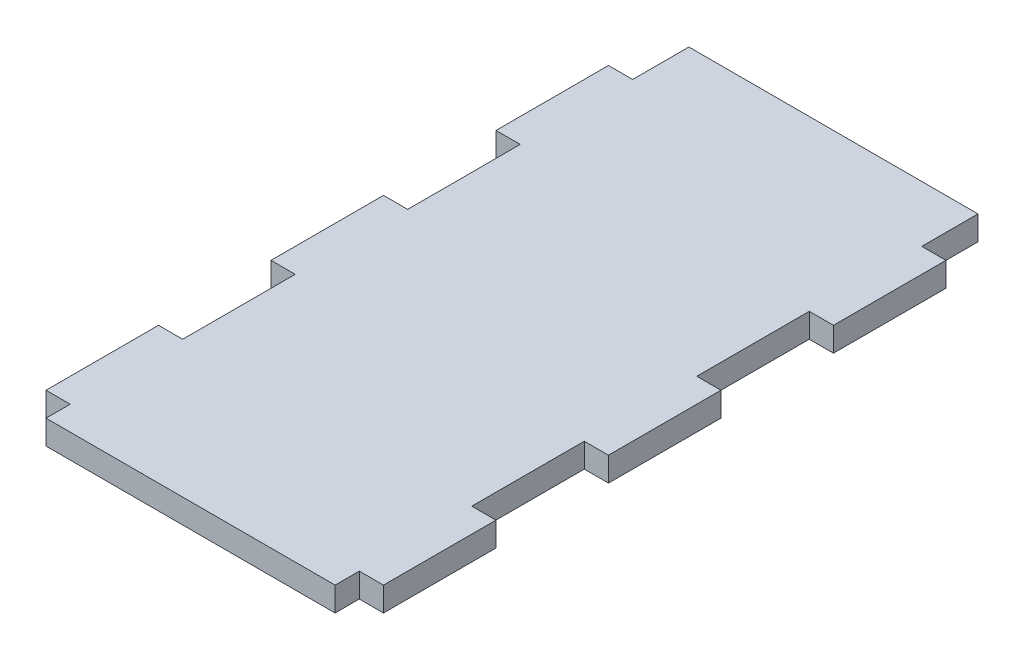
ISO-10303-21;
HEADER;
FILE_DESCRIPTION(('STEP AP214'),'2;1');
FILE_NAME('part.step','',(''),(''),'','','');
FILE_SCHEMA(('AUTOMOTIVE_DESIGN { 1 0 10303 214 1 1 1 1 }'));
ENDSEC;
DATA;
#1=APPLICATION_CONTEXT('core data for automotive mechanical design processes');
#2=APPLICATION_PROTOCOL_DEFINITION('international standard','automotive_design',2000,#1);
#3=PRODUCT_CONTEXT('',#1,'mechanical');
#4=PRODUCT('Part','Part','',(#3));
#5=PRODUCT_RELATED_PRODUCT_CATEGORY('part','',(#4));
#6=PRODUCT_DEFINITION_FORMATION('','',#4);
#7=PRODUCT_DEFINITION_CONTEXT('part definition',#1,'design');
#8=PRODUCT_DEFINITION('design','',#6,#7);
#9=PRODUCT_DEFINITION_SHAPE('','',#8);
#10=(LENGTH_UNIT() NAMED_UNIT(*) SI_UNIT(.MILLI.,.METRE.));
#11=(NAMED_UNIT(*) PLANE_ANGLE_UNIT() SI_UNIT($,.RADIAN.));
#12=(NAMED_UNIT(*) SI_UNIT($,.STERADIAN.) SOLID_ANGLE_UNIT());
#13=UNCERTAINTY_MEASURE_WITH_UNIT(LENGTH_MEASURE(1.E-05),#10,'distance_accuracy_value','');
#14=(GEOMETRIC_REPRESENTATION_CONTEXT(3) GLOBAL_UNCERTAINTY_ASSIGNED_CONTEXT((#13)) GLOBAL_UNIT_ASSIGNED_CONTEXT((#10,
#11,#12)) REPRESENTATION_CONTEXT('',''));
#15=CARTESIAN_POINT('',(0.,0.,0.));
#16=DIRECTION('',(0.,0.,1.));
#17=DIRECTION('',(1.,0.,0.));
#18=AXIS2_PLACEMENT_3D('',#15,#16,#17);
#19=CARTESIAN_POINT('',(38.1,5.461,-63.5));
#20=DIRECTION('',(0.,0.,1.));
#21=DIRECTION('',(1.,0.,0.));
#22=AXIS2_PLACEMENT_3D('',#19,#20,#21);
#23=PLANE('',#22);
#24=DIRECTION('',(0.,-1.,0.));
#25=VECTOR('',#24,1.);
#26=CARTESIAN_POINT('',(32.639,5.461,-63.5));
#27=LINE('',#26,#25);
#28=CARTESIAN_POINT('',(32.639,5.461,-63.5));
#29=VERTEX_POINT('',#28);
#30=CARTESIAN_POINT('',(32.639,0.,-63.5));
#31=VERTEX_POINT('',#30);
#32=EDGE_CURVE('E249',#29,#31,#27,.T.);
#33=ORIENTED_EDGE('',*,*,#32,.F.);
#34=DIRECTION('',(-1.,0.,0.));
#35=VECTOR('',#34,1.);
#36=CARTESIAN_POINT('',(38.1,5.461,-63.5));
#37=LINE('',#36,#35);
#38=CARTESIAN_POINT('',(38.1,5.461,-63.5));
#39=VERTEX_POINT('',#38);
#40=EDGE_CURVE('E393',#39,#29,#37,.T.);
#41=ORIENTED_EDGE('',*,*,#40,.F.);
#42=DIRECTION('',(0.,-1.,0.));
#43=VECTOR('',#42,1.);
#44=CARTESIAN_POINT('',(38.1,5.461,-63.5));
#45=LINE('',#44,#43);
#46=CARTESIAN_POINT('',(38.1,0.,-63.5));
#47=VERTEX_POINT('',#46);
#48=EDGE_CURVE('E414',#39,#47,#45,.T.);
#49=ORIENTED_EDGE('',*,*,#48,.T.);
#50=DIRECTION('',(-1.,0.,0.));
#51=VECTOR('',#50,1.);
#52=CARTESIAN_POINT('',(38.1,0.,-63.5));
#53=LINE('',#52,#51);
#54=EDGE_CURVE('E64',#47,#31,#53,.T.);
#55=ORIENTED_EDGE('',*,*,#54,.T.);
#56=EDGE_LOOP('',(#33,#41,#49,#55));
#57=FACE_BOUND('',#56,.T.);
#58=ADVANCED_FACE('F41',(#57),#23,.F.);
#59=DIRECTION('',(0.,1.,0.));
#60=VECTOR('',#59,1.);
#61=CARTESIAN_POINT('',(-32.639,5.46100000000001,-63.5));
#62=LINE('',#61,#60);
#63=CARTESIAN_POINT('',(-32.639,0.,-63.5));
#64=VERTEX_POINT('',#63);
#65=CARTESIAN_POINT('',(-32.639,5.46100000000001,-63.5));
#66=VERTEX_POINT('',#65);
#67=EDGE_CURVE('E56',#64,#66,#62,.T.);
#68=ORIENTED_EDGE('',*,*,#67,.F.);
#69=CARTESIAN_POINT('',(-38.1,0.,-63.5));
#70=VERTEX_POINT('',#69);
#71=EDGE_CURVE('E409',#64,#70,#53,.T.);
#72=ORIENTED_EDGE('',*,*,#71,.T.);
#73=DIRECTION('',(0.,-1.,0.));
#74=VECTOR('',#73,1.);
#75=CARTESIAN_POINT('',(-38.1,5.461,-63.5));
#76=LINE('',#75,#74);
#77=CARTESIAN_POINT('',(-38.1,5.461,-63.5));
#78=VERTEX_POINT('',#77);
#79=EDGE_CURVE('E396',#78,#70,#76,.T.);
#80=ORIENTED_EDGE('',*,*,#79,.F.);
#81=EDGE_CURVE('E391',#66,#78,#37,.T.);
#82=ORIENTED_EDGE('',*,*,#81,.F.);
#83=EDGE_LOOP('',(#68,#72,#80,#82));
#84=FACE_BOUND('',#83,.T.);
#85=ADVANCED_FACE('F493',(#84),#23,.F.);
#86=CARTESIAN_POINT('',(38.1,5.461,63.5));
#87=DIRECTION('',(0.,0.,-1.));
#88=DIRECTION('',(-1.,0.,0.));
#89=AXIS2_PLACEMENT_3D('',#86,#87,#88);
#90=PLANE('',#89);
#91=DIRECTION('',(0.,-1.,0.));
#92=VECTOR('',#91,1.);
#93=CARTESIAN_POINT('',(-32.639,5.461,63.5));
#94=LINE('',#93,#92);
#95=CARTESIAN_POINT('',(-32.639,5.461,63.5));
#96=VERTEX_POINT('',#95);
#97=CARTESIAN_POINT('',(-32.639,0.,63.5));
#98=VERTEX_POINT('',#97);
#99=EDGE_CURVE('E250',#96,#98,#94,.T.);
#100=ORIENTED_EDGE('',*,*,#99,.F.);
#101=DIRECTION('',(1.,0.,0.));
#102=VECTOR('',#101,1.);
#103=CARTESIAN_POINT('',(38.1,5.461,63.5));
#104=LINE('',#103,#102);
#105=CARTESIAN_POINT('',(-38.1,5.461,63.5));
#106=VERTEX_POINT('',#105);
#107=EDGE_CURVE('E384',#106,#96,#104,.T.);
#108=ORIENTED_EDGE('',*,*,#107,.F.);
#109=DIRECTION('',(0.,-1.,0.));
#110=VECTOR('',#109,1.);
#111=CARTESIAN_POINT('',(-38.1,5.461,63.5));
#112=LINE('',#111,#110);
#113=CARTESIAN_POINT('',(-38.1,0.,63.5));
#114=VERTEX_POINT('',#113);
#115=EDGE_CURVE('E12',#106,#114,#112,.T.);
#116=ORIENTED_EDGE('',*,*,#115,.T.);
#117=DIRECTION('',(1.,0.,0.));
#118=VECTOR('',#117,1.);
#119=CARTESIAN_POINT('',(38.1,0.,63.5));
#120=LINE('',#119,#118);
#121=EDGE_CURVE('E403',#114,#98,#120,.T.);
#122=ORIENTED_EDGE('',*,*,#121,.T.);
#123=EDGE_LOOP('',(#100,#108,#116,#122));
#124=FACE_BOUND('',#123,.T.);
#125=ADVANCED_FACE('F456',(#124),#90,.F.);
#126=DIRECTION('',(0.,1.,0.));
#127=VECTOR('',#126,1.);
#128=CARTESIAN_POINT('',(32.639,5.46100000000001,63.5));
#129=LINE('',#128,#127);
#130=CARTESIAN_POINT('',(32.639,0.,63.5));
#131=VERTEX_POINT('',#130);
#132=CARTESIAN_POINT('',(32.639,5.46100000000001,63.5));
#133=VERTEX_POINT('',#132);
#134=EDGE_CURVE('E253',#131,#133,#129,.T.);
#135=ORIENTED_EDGE('',*,*,#134,.F.);
#136=CARTESIAN_POINT('',(38.1,0.,63.5));
#137=VERTEX_POINT('',#136);
#138=EDGE_CURVE('E400',#131,#137,#120,.T.);
#139=ORIENTED_EDGE('',*,*,#138,.T.);
#140=DIRECTION('',(0.,-1.,0.));
#141=VECTOR('',#140,1.);
#142=CARTESIAN_POINT('',(38.1,5.461,63.5));
#143=LINE('',#142,#141);
#144=CARTESIAN_POINT('',(38.1,5.461,63.5));
#145=VERTEX_POINT('',#144);
#146=EDGE_CURVE('E49',#145,#137,#143,.T.);
#147=ORIENTED_EDGE('',*,*,#146,.F.);
#148=EDGE_CURVE('E381',#133,#145,#104,.T.);
#149=ORIENTED_EDGE('',*,*,#148,.F.);
#150=EDGE_LOOP('',(#135,#139,#147,#149));
#151=FACE_BOUND('',#150,.T.);
#152=ADVANCED_FACE('F442',(#151),#90,.F.);
#153=CARTESIAN_POINT('',(-38.1,5.461,63.5));
#154=DIRECTION('',(1.,0.,0.));
#155=DIRECTION('',(0.,0.,-1.));
#156=AXIS2_PLACEMENT_3D('',#153,#154,#155);
#157=PLANE('',#156);
#158=DIRECTION('',(0.,0.,1.));
#159=VECTOR('',#158,1.);
#160=CARTESIAN_POINT('',(-38.1,0.,63.5));
#161=LINE('',#160,#159);
#162=CARTESIAN_POINT('',(-38.100000000001,0.,-38.0999999999997));
#163=VERTEX_POINT('',#162);
#164=EDGE_CURVE('E397',#70,#163,#161,.T.);
#165=ORIENTED_EDGE('',*,*,#164,.T.);
#166=DIRECTION('',(0.,1.,0.));
#167=VECTOR('',#166,1.);
#168=CARTESIAN_POINT('',(-38.100000000001,0.,-38.0999999999997));
#169=LINE('',#168,#167);
#170=CARTESIAN_POINT('',(-38.100000000001,5.46099999999997,-38.0999999999998));
#171=VERTEX_POINT('',#170);
#172=EDGE_CURVE('E299',#163,#171,#169,.T.);
#173=ORIENTED_EDGE('',*,*,#172,.T.);
#174=DIRECTION('',(0.,0.,1.));
#175=VECTOR('',#174,1.);
#176=CARTESIAN_POINT('',(-38.1,5.461,63.5));
#177=LINE('',#176,#175);
#178=EDGE_CURVE('E378',#78,#171,#177,.T.);
#179=ORIENTED_EDGE('',*,*,#178,.F.);
#180=ORIENTED_EDGE('',*,*,#79,.T.);
#181=EDGE_LOOP('',(#165,#173,#179,#180));
#182=FACE_BOUND('',#181,.T.);
#183=ADVANCED_FACE('F490',(#182),#157,.F.);
#184=CARTESIAN_POINT('',(-38.1000000000009,5.46099999999996,-12.6999999999998));
#185=VERTEX_POINT('',#184);
#186=CARTESIAN_POINT('',(-38.1000000000008,5.46099999999996,12.7000000000002));
#187=VERTEX_POINT('',#186);
#188=EDGE_CURVE('E382',#185,#187,#177,.T.);
#189=ORIENTED_EDGE('',*,*,#188,.F.);
#190=DIRECTION('',(0.,-1.,0.));
#191=VECTOR('',#190,1.);
#192=CARTESIAN_POINT('',(-38.1000000000009,0.,-12.6999999999997));
#193=LINE('',#192,#191);
#194=CARTESIAN_POINT('',(-38.1000000000009,0.,-12.6999999999997));
#195=VERTEX_POINT('',#194);
#196=EDGE_CURVE('E287',#185,#195,#193,.T.);
#197=ORIENTED_EDGE('',*,*,#196,.T.);
#198=CARTESIAN_POINT('',(-38.1000000000008,0.,12.7000000000002));
#199=VERTEX_POINT('',#198);
#200=EDGE_CURVE('E401',#195,#199,#161,.T.);
#201=ORIENTED_EDGE('',*,*,#200,.T.);
#202=DIRECTION('',(0.,1.,0.));
#203=VECTOR('',#202,1.);
#204=CARTESIAN_POINT('',(-38.1000000000008,0.,12.7000000000002));
#205=LINE('',#204,#203);
#206=EDGE_CURVE('E290',#199,#187,#205,.T.);
#207=ORIENTED_EDGE('',*,*,#206,.T.);
#208=EDGE_LOOP('',(#189,#197,#201,#207));
#209=FACE_BOUND('',#208,.T.);
#210=ADVANCED_FACE('F466',(#209),#157,.F.);
#211=CARTESIAN_POINT('',(38.1,5.461,63.5));
#212=DIRECTION('',(-1.,0.,0.));
#213=DIRECTION('',(0.,0.,1.));
#214=AXIS2_PLACEMENT_3D('',#211,#212,#213);
#215=PLANE('',#214);
#216=DIRECTION('',(0.,-1.,0.));
#217=VECTOR('',#216,1.);
#218=CARTESIAN_POINT('',(38.0999999999997,1.66533453693773E-13,38.1));
#219=LINE('',#218,#217);
#220=CARTESIAN_POINT('',(38.0999999999996,5.46100000000015,38.1));
#221=VERTEX_POINT('',#220);
#222=CARTESIAN_POINT('',(38.0999999999997,1.66533453693773E-13,38.1));
#223=VERTEX_POINT('',#222);
#224=EDGE_CURVE('E361',#221,#223,#219,.T.);
#225=ORIENTED_EDGE('',*,*,#224,.F.);
#226=DIRECTION('',(0.,0.,-1.));
#227=VECTOR('',#226,1.);
#228=CARTESIAN_POINT('',(38.1,5.461,63.5));
#229=LINE('',#228,#227);
#230=EDGE_CURVE('E388',#145,#221,#229,.T.);
#231=ORIENTED_EDGE('',*,*,#230,.F.);
#232=ORIENTED_EDGE('',*,*,#146,.T.);
#233=DIRECTION('',(0.,0.,-1.));
#234=VECTOR('',#233,1.);
#235=CARTESIAN_POINT('',(38.1,0.,63.5));
#236=LINE('',#235,#234);
#237=EDGE_CURVE('E406',#137,#223,#236,.T.);
#238=ORIENTED_EDGE('',*,*,#237,.T.);
#239=EDGE_LOOP('',(#225,#231,#232,#238));
#240=FACE_BOUND('',#239,.T.);
#241=ADVANCED_FACE('F421',(#240),#215,.F.);
#242=DIRECTION('',(0.,1.,0.));
#243=VECTOR('',#242,1.);
#244=CARTESIAN_POINT('',(38.0999999999997,1.80411241501588E-13,12.7));
#245=LINE('',#244,#243);
#246=CARTESIAN_POINT('',(38.0999999999997,1.80411241501588E-13,12.7));
#247=VERTEX_POINT('',#246);
#248=CARTESIAN_POINT('',(38.0999999999996,5.46100000000014,12.7));
#249=VERTEX_POINT('',#248);
#250=EDGE_CURVE('E329',#247,#249,#245,.T.);
#251=ORIENTED_EDGE('',*,*,#250,.F.);
#252=CARTESIAN_POINT('',(38.0999999999997,2.08166817117217E-13,-12.6999999999999));
#253=VERTEX_POINT('',#252);
#254=EDGE_CURVE('E410',#247,#253,#236,.T.);
#255=ORIENTED_EDGE('',*,*,#254,.T.);
#256=DIRECTION('',(0.,-1.,0.));
#257=VECTOR('',#256,1.);
#258=CARTESIAN_POINT('',(38.0999999999997,2.08166817117217E-13,-12.6999999999999));
#259=LINE('',#258,#257);
#260=CARTESIAN_POINT('',(38.0999999999996,5.46100000000014,-12.6999999999999));
#261=VERTEX_POINT('',#260);
#262=EDGE_CURVE('E331',#261,#253,#259,.T.);
#263=ORIENTED_EDGE('',*,*,#262,.F.);
#264=EDGE_CURVE('E392',#249,#261,#229,.T.);
#265=ORIENTED_EDGE('',*,*,#264,.F.);
#266=EDGE_LOOP('',(#251,#255,#263,#265));
#267=FACE_BOUND('',#266,.T.);
#268=ADVANCED_FACE('F517',(#267),#215,.F.);
#269=DIRECTION('',(0.,1.,0.));
#270=VECTOR('',#269,1.);
#271=CARTESIAN_POINT('',(38.0999999999997,2.15105711021124E-13,-38.0999999999999));
#272=LINE('',#271,#270);
#273=CARTESIAN_POINT('',(38.0999999999997,2.15105711021124E-13,-38.0999999999999));
#274=VERTEX_POINT('',#273);
#275=CARTESIAN_POINT('',(38.0999999999996,5.46100000000015,-38.1));
#276=VERTEX_POINT('',#275);
#277=EDGE_CURVE('E351',#274,#276,#272,.T.);
#278=ORIENTED_EDGE('',*,*,#277,.F.);
#279=EDGE_CURVE('E405',#274,#47,#236,.T.);
#280=ORIENTED_EDGE('',*,*,#279,.T.);
#281=ORIENTED_EDGE('',*,*,#48,.F.);
#282=EDGE_CURVE('E387',#276,#39,#229,.T.);
#283=ORIENTED_EDGE('',*,*,#282,.F.);
#284=EDGE_LOOP('',(#278,#280,#281,#283));
#285=FACE_BOUND('',#284,.T.);
#286=ADVANCED_FACE('F526',(#285),#215,.F.);
#287=CARTESIAN_POINT('',(0.,0.,0.));
#288=DIRECTION('',(0.,1.,0.));
#289=DIRECTION('',(0.,0.,1.));
#290=AXIS2_PLACEMENT_3D('',#287,#288,#289);
#291=PLANE('',#290);
#292=DIRECTION('',(0.,0.,-1.));
#293=VECTOR('',#292,1.);
#294=CARTESIAN_POINT('',(-32.6390000000004,0.,82.9351920908021));
#295=LINE('',#294,#293);
#296=CARTESIAN_POINT('',(-32.6390000000009,0.,-12.6999999999998));
#297=VERTEX_POINT('',#296);
#298=CARTESIAN_POINT('',(-32.639000000001,0.,-38.0999999999998));
#299=VERTEX_POINT('',#298);
#300=EDGE_CURVE('E315',#297,#299,#295,.T.);
#301=ORIENTED_EDGE('',*,*,#300,.T.);
#302=DIRECTION('',(-1.,0.,0.));
#303=VECTOR('',#302,1.);
#304=CARTESIAN_POINT('',(-32.639000000001,0.,-38.0999999999998));
#305=LINE('',#304,#303);
#306=EDGE_CURVE('E312',#299,#163,#305,.T.);
#307=ORIENTED_EDGE('',*,*,#306,.T.);
#308=ORIENTED_EDGE('',*,*,#164,.F.);
#309=ORIENTED_EDGE('',*,*,#71,.F.);
#310=DIRECTION('',(0.,0.,1.));
#311=VECTOR('',#310,1.);
#312=CARTESIAN_POINT('',(-32.639,0.,-76.2));
#313=LINE('',#312,#311);
#314=CARTESIAN_POINT('',(-32.639,0.,-76.2));
#315=VERTEX_POINT('',#314);
#316=EDGE_CURVE('E234',#315,#64,#313,.T.);
#317=ORIENTED_EDGE('',*,*,#316,.F.);
#318=DIRECTION('',(-1.,0.,0.));
#319=VECTOR('',#318,1.);
#320=CARTESIAN_POINT('',(32.639,0.,-76.2));
#321=LINE('',#320,#319);
#322=CARTESIAN_POINT('',(32.639,0.,-76.2));
#323=VERTEX_POINT('',#322);
#324=EDGE_CURVE('E226',#323,#315,#321,.T.);
#325=ORIENTED_EDGE('',*,*,#324,.F.);
#326=DIRECTION('',(0.,0.,1.));
#327=VECTOR('',#326,1.);
#328=CARTESIAN_POINT('',(32.639,0.,-76.2));
#329=LINE('',#328,#327);
#330=EDGE_CURVE('E231',#323,#31,#329,.T.);
#331=ORIENTED_EDGE('',*,*,#330,.T.);
#332=ORIENTED_EDGE('',*,*,#54,.F.);
#333=ORIENTED_EDGE('',*,*,#279,.F.);
#334=DIRECTION('',(-1.,0.,0.));
#335=VECTOR('',#334,1.);
#336=CARTESIAN_POINT('',(38.0999999999997,2.15105711021124E-13,-38.0999999999999));
#337=LINE('',#336,#335);
#338=CARTESIAN_POINT('',(32.6389999999997,1.89084858881472E-13,-38.0999999999999));
#339=VERTEX_POINT('',#338);
#340=EDGE_CURVE('E356',#274,#339,#337,.T.);
#341=ORIENTED_EDGE('',*,*,#340,.T.);
#342=DIRECTION('',(0.,0.,-1.));
#343=VECTOR('',#342,1.);
#344=CARTESIAN_POINT('',(32.6389999999997,1.28369537222284E-13,82.9351920908019));
#345=LINE('',#344,#343);
#346=CARTESIAN_POINT('',(32.6389999999997,0.,-12.6999999999999));
#347=VERTEX_POINT('',#346);
#348=EDGE_CURVE('E359',#347,#339,#345,.T.);
#349=ORIENTED_EDGE('',*,*,#348,.F.);
#350=DIRECTION('',(-1.,0.,0.));
#351=VECTOR('',#350,1.);
#352=CARTESIAN_POINT('',(38.0999999999997,2.08166817117217E-13,-12.6999999999999));
#353=LINE('',#352,#351);
#354=EDGE_CURVE('E345',#253,#347,#353,.T.);
#355=ORIENTED_EDGE('',*,*,#354,.F.);
#356=ORIENTED_EDGE('',*,*,#254,.F.);
#357=DIRECTION('',(-1.,0.,0.));
#358=VECTOR('',#357,1.);
#359=CARTESIAN_POINT('',(38.0999999999997,1.80411241501588E-13,12.7));
#360=LINE('',#359,#358);
#361=CARTESIAN_POINT('',(32.6389999999997,1.54390389361936E-13,12.7));
#362=VERTEX_POINT('',#361);
#363=EDGE_CURVE('E341',#247,#362,#360,.T.);
#364=ORIENTED_EDGE('',*,*,#363,.T.);
#365=CARTESIAN_POINT('',(32.6389999999997,0.,38.1));
#366=VERTEX_POINT('',#365);
#367=EDGE_CURVE('E323',#366,#362,#345,.T.);
#368=ORIENTED_EDGE('',*,*,#367,.F.);
#369=DIRECTION('',(-1.,0.,0.));
#370=VECTOR('',#369,1.);
#371=CARTESIAN_POINT('',(38.0999999999997,1.66533453693773E-13,38.1));
#372=LINE('',#371,#370);
#373=EDGE_CURVE('E338',#223,#366,#372,.T.);
#374=ORIENTED_EDGE('',*,*,#373,.F.);
#375=ORIENTED_EDGE('',*,*,#237,.F.);
#376=ORIENTED_EDGE('',*,*,#138,.F.);
#377=DIRECTION('',(0.,0.,-1.));
#378=VECTOR('',#377,1.);
#379=CARTESIAN_POINT('',(32.639,0.,68.961));
#380=LINE('',#379,#378);
#381=CARTESIAN_POINT('',(32.639,0.,68.961));
#382=VERTEX_POINT('',#381);
#383=EDGE_CURVE('E276',#382,#131,#380,.T.);
#384=ORIENTED_EDGE('',*,*,#383,.F.);
#385=DIRECTION('',(1.,0.,0.));
#386=VECTOR('',#385,1.);
#387=CARTESIAN_POINT('',(-32.639,0.,68.961));
#388=LINE('',#387,#386);
#389=CARTESIAN_POINT('',(-32.639,0.,68.961));
#390=VERTEX_POINT('',#389);
#391=EDGE_CURVE('E262',#390,#382,#388,.T.);
#392=ORIENTED_EDGE('',*,*,#391,.F.);
#393=DIRECTION('',(0.,0.,-1.));
#394=VECTOR('',#393,1.);
#395=CARTESIAN_POINT('',(-32.639,0.,68.961));
#396=LINE('',#395,#394);
#397=EDGE_CURVE('E279',#390,#98,#396,.T.);
#398=ORIENTED_EDGE('',*,*,#397,.T.);
#399=ORIENTED_EDGE('',*,*,#121,.F.);
#400=CARTESIAN_POINT('',(-38.1000000000006,0.,38.1000000000002));
#401=VERTEX_POINT('',#400);
#402=EDGE_CURVE('E402',#401,#114,#161,.T.);
#403=ORIENTED_EDGE('',*,*,#402,.F.);
#404=DIRECTION('',(-1.,0.,0.));
#405=VECTOR('',#404,1.);
#406=CARTESIAN_POINT('',(-32.6390000000006,0.,38.1000000000002));
#407=LINE('',#406,#405);
#408=CARTESIAN_POINT('',(-32.6390000000006,0.,38.1000000000002));
#409=VERTEX_POINT('',#408);
#410=EDGE_CURVE('E293',#409,#401,#407,.T.);
#411=ORIENTED_EDGE('',*,*,#410,.F.);
#412=CARTESIAN_POINT('',(-32.6390000000008,0.,12.7000000000002));
#413=VERTEX_POINT('',#412);
#414=EDGE_CURVE('E328',#409,#413,#295,.T.);
#415=ORIENTED_EDGE('',*,*,#414,.T.);
#416=DIRECTION('',(-1.,0.,0.));
#417=VECTOR('',#416,1.);
#418=CARTESIAN_POINT('',(-32.6390000000008,0.,12.7000000000002));
#419=LINE('',#418,#417);
#420=EDGE_CURVE('E296',#413,#199,#419,.T.);
#421=ORIENTED_EDGE('',*,*,#420,.T.);
#422=ORIENTED_EDGE('',*,*,#200,.F.);
#423=DIRECTION('',(-1.,0.,0.));
#424=VECTOR('',#423,1.);
#425=CARTESIAN_POINT('',(-32.6390000000009,0.,-12.6999999999998));
#426=LINE('',#425,#424);
#427=EDGE_CURVE('E300',#297,#195,#426,.T.);
#428=ORIENTED_EDGE('',*,*,#427,.F.);
#429=EDGE_LOOP('',(#301,#307,#308,#309,#317,#325,#331,#332,#333,#341,#349,#355,#356,#364,#368,
#374,#375,#376,#384,#392,#398,#399,#403,#411,#415,#421,#422,#428));
#430=FACE_BOUND('',#429,.T.);
#431=ADVANCED_FACE('F229',(#430),#291,.F.);
#432=CARTESIAN_POINT('',(-38.1000000000006,5.46099999999997,38.1000000000002));
#433=VERTEX_POINT('',#432);
#434=EDGE_CURVE('E383',#433,#106,#177,.T.);
#435=ORIENTED_EDGE('',*,*,#434,.F.);
#436=DIRECTION('',(0.,-1.,0.));
#437=VECTOR('',#436,1.);
#438=CARTESIAN_POINT('',(-38.1000000000006,0.,38.1000000000002));
#439=LINE('',#438,#437);
#440=EDGE_CURVE('E320',#433,#401,#439,.T.);
#441=ORIENTED_EDGE('',*,*,#440,.T.);
#442=ORIENTED_EDGE('',*,*,#402,.T.);
#443=ORIENTED_EDGE('',*,*,#115,.F.);
#444=EDGE_LOOP('',(#435,#441,#442,#443));
#445=FACE_BOUND('',#444,.T.);
#446=ADVANCED_FACE('F43',(#445),#157,.F.);
#447=CARTESIAN_POINT('',(0.,5.461,0.));
#448=DIRECTION('',(0.,1.,0.));
#449=DIRECTION('',(0.,0.,1.));
#450=AXIS2_PLACEMENT_3D('',#447,#448,#449);
#451=PLANE('',#450);
#452=DIRECTION('',(-1.,0.,0.));
#453=VECTOR('',#452,1.);
#454=CARTESIAN_POINT('',(-32.639000000001,5.46099999999997,-38.0999999999998));
#455=LINE('',#454,#453);
#456=CARTESIAN_POINT('',(-32.639000000001,5.46099999999997,-38.0999999999998));
#457=VERTEX_POINT('',#456);
#458=EDGE_CURVE('E309',#457,#171,#455,.T.);
#459=ORIENTED_EDGE('',*,*,#458,.F.);
#460=DIRECTION('',(0.,0.,1.));
#461=VECTOR('',#460,1.);
#462=CARTESIAN_POINT('',(-32.6390000000008,5.461,1.64696710789036E-13));
#463=LINE('',#462,#461);
#464=CARTESIAN_POINT('',(-32.6390000000009,5.46099999999996,-12.6999999999998));
#465=VERTEX_POINT('',#464);
#466=EDGE_CURVE('E377',#457,#465,#463,.T.);
#467=ORIENTED_EDGE('',*,*,#466,.T.);
#468=DIRECTION('',(-1.,0.,0.));
#469=VECTOR('',#468,1.);
#470=CARTESIAN_POINT('',(-32.6390000000009,5.46099999999996,-12.6999999999998));
#471=LINE('',#470,#469);
#472=EDGE_CURVE('E302',#465,#185,#471,.T.);
#473=ORIENTED_EDGE('',*,*,#472,.T.);
#474=ORIENTED_EDGE('',*,*,#188,.T.);
#475=DIRECTION('',(-1.,0.,0.));
#476=VECTOR('',#475,1.);
#477=CARTESIAN_POINT('',(-32.6390000000008,5.46099999999996,12.7000000000002));
#478=LINE('',#477,#476);
#479=CARTESIAN_POINT('',(-32.6390000000008,5.46099999999996,12.7000000000002));
#480=VERTEX_POINT('',#479);
#481=EDGE_CURVE('E289',#480,#187,#478,.T.);
#482=ORIENTED_EDGE('',*,*,#481,.F.);
#483=CARTESIAN_POINT('',(-32.6390000000006,5.46099999999997,38.1000000000002));
#484=VERTEX_POINT('',#483);
#485=EDGE_CURVE('E374',#480,#484,#463,.T.);
#486=ORIENTED_EDGE('',*,*,#485,.T.);
#487=DIRECTION('',(-1.,0.,0.));
#488=VECTOR('',#487,1.);
#489=CARTESIAN_POINT('',(-32.6390000000006,5.46099999999997,38.1000000000002));
#490=LINE('',#489,#488);
#491=EDGE_CURVE('E319',#484,#433,#490,.T.);
#492=ORIENTED_EDGE('',*,*,#491,.T.);
#493=ORIENTED_EDGE('',*,*,#434,.T.);
#494=ORIENTED_EDGE('',*,*,#107,.T.);
#495=DIRECTION('',(0.,0.,-1.));
#496=VECTOR('',#495,1.);
#497=CARTESIAN_POINT('',(-32.639,5.461,68.961));
#498=LINE('',#497,#496);
#499=CARTESIAN_POINT('',(-32.639,5.461,68.961));
#500=VERTEX_POINT('',#499);
#501=EDGE_CURVE('E267',#500,#96,#498,.T.);
#502=ORIENTED_EDGE('',*,*,#501,.F.);
#503=DIRECTION('',(-1.,0.,0.));
#504=VECTOR('',#503,1.);
#505=CARTESIAN_POINT('',(-32.639,5.461,68.961));
#506=LINE('',#505,#504);
#507=CARTESIAN_POINT('',(32.639,5.46100000000001,68.961));
#508=VERTEX_POINT('',#507);
#509=EDGE_CURVE('E266',#508,#500,#506,.T.);
#510=ORIENTED_EDGE('',*,*,#509,.F.);
#511=DIRECTION('',(0.,0.,-1.));
#512=VECTOR('',#511,1.);
#513=CARTESIAN_POINT('',(32.639,5.46100000000001,68.961));
#514=LINE('',#513,#512);
#515=EDGE_CURVE('E273',#508,#133,#514,.T.);
#516=ORIENTED_EDGE('',*,*,#515,.T.);
#517=ORIENTED_EDGE('',*,*,#148,.T.);
#518=ORIENTED_EDGE('',*,*,#230,.T.);
#519=DIRECTION('',(-1.,0.,0.));
#520=VECTOR('',#519,1.);
#521=CARTESIAN_POINT('',(38.0999999999996,5.46100000000015,38.1));
#522=LINE('',#521,#520);
#523=CARTESIAN_POINT('',(32.6389999999996,5.46100000000012,38.1));
#524=VERTEX_POINT('',#523);
#525=EDGE_CURVE('E363',#221,#524,#522,.T.);
#526=ORIENTED_EDGE('',*,*,#525,.T.);
#527=DIRECTION('',(0.,0.,1.));
#528=VECTOR('',#527,1.);
#529=CARTESIAN_POINT('',(32.6389999999996,5.461,0.));
#530=LINE('',#529,#528);
#531=CARTESIAN_POINT('',(32.6389999999996,5.46100000000011,12.7));
#532=VERTEX_POINT('',#531);
#533=EDGE_CURVE('E371',#532,#524,#530,.T.);
#534=ORIENTED_EDGE('',*,*,#533,.F.);
#535=DIRECTION('',(-1.,0.,0.));
#536=VECTOR('',#535,1.);
#537=CARTESIAN_POINT('',(38.0999999999996,5.46100000000014,12.7));
#538=LINE('',#537,#536);
#539=EDGE_CURVE('E334',#249,#532,#538,.T.);
#540=ORIENTED_EDGE('',*,*,#539,.F.);
#541=ORIENTED_EDGE('',*,*,#264,.T.);
#542=DIRECTION('',(-1.,0.,0.));
#543=VECTOR('',#542,1.);
#544=CARTESIAN_POINT('',(38.0999999999996,5.46100000000014,-12.6999999999999));
#545=LINE('',#544,#543);
#546=CARTESIAN_POINT('',(32.6389999999996,5.46100000000011,-12.6999999999999));
#547=VERTEX_POINT('',#546);
#548=EDGE_CURVE('E347',#261,#547,#545,.T.);
#549=ORIENTED_EDGE('',*,*,#548,.T.);
#550=CARTESIAN_POINT('',(32.6389999999996,5.46100000000012,-38.1));
#551=VERTEX_POINT('',#550);
#552=EDGE_CURVE('E373',#551,#547,#530,.T.);
#553=ORIENTED_EDGE('',*,*,#552,.F.);
#554=DIRECTION('',(-1.,0.,0.));
#555=VECTOR('',#554,1.);
#556=CARTESIAN_POINT('',(38.0999999999996,5.46100000000015,-38.1));
#557=LINE('',#556,#555);
#558=EDGE_CURVE('E353',#276,#551,#557,.T.);
#559=ORIENTED_EDGE('',*,*,#558,.F.);
#560=ORIENTED_EDGE('',*,*,#282,.T.);
#561=ORIENTED_EDGE('',*,*,#40,.T.);
#562=DIRECTION('',(0.,0.,1.));
#563=VECTOR('',#562,1.);
#564=CARTESIAN_POINT('',(32.639,5.461,-76.2));
#565=LINE('',#564,#563);
#566=CARTESIAN_POINT('',(32.639,5.461,-76.2));
#567=VERTEX_POINT('',#566);
#568=EDGE_CURVE('E499',#567,#29,#565,.T.);
#569=ORIENTED_EDGE('',*,*,#568,.F.);
#570=DIRECTION('',(1.,0.,0.));
#571=VECTOR('',#570,1.);
#572=CARTESIAN_POINT('',(32.639,5.461,-76.2));
#573=LINE('',#572,#571);
#574=CARTESIAN_POINT('',(-32.639,5.46100000000001,-76.2));
#575=VERTEX_POINT('',#574);
#576=EDGE_CURVE('E243',#575,#567,#573,.T.);
#577=ORIENTED_EDGE('',*,*,#576,.F.);
#578=DIRECTION('',(0.,0.,1.));
#579=VECTOR('',#578,1.);
#580=CARTESIAN_POINT('',(-32.639,5.46100000000001,-76.2));
#581=LINE('',#580,#579);
#582=EDGE_CURVE('E255',#575,#66,#581,.T.);
#583=ORIENTED_EDGE('',*,*,#582,.T.);
#584=ORIENTED_EDGE('',*,*,#81,.T.);
#585=ORIENTED_EDGE('',*,*,#178,.T.);
#586=EDGE_LOOP('',(#459,#467,#473,#474,#482,#486,#492,#493,#494,#502,#510,#516,#517,#518,#526,
#534,#540,#541,#549,#553,#559,#560,#561,#569,#577,#583,#584,#585));
#587=FACE_BOUND('',#586,.T.);
#588=ADVANCED_FACE('F437',(#587),#451,.T.);
#589=CARTESIAN_POINT('',(32.6389999999996,6.73519209080199,82.9351920908019));
#590=DIRECTION('',(-1.,0.,0.));
#591=DIRECTION('',(0.,0.707106781186548,-0.707106781186548));
#592=AXIS2_PLACEMENT_3D('',#589,#590,#591);
#593=PLANE('',#592);
#594=ORIENTED_EDGE('',*,*,#533,.T.);
#595=DIRECTION('',(0.,-1.,0.));
#596=VECTOR('',#595,1.);
#597=CARTESIAN_POINT('',(32.6389999999997,1.40512601554121E-13,38.1));
#598=LINE('',#597,#596);
#599=EDGE_CURVE('E282',#524,#366,#598,.T.);
#600=ORIENTED_EDGE('',*,*,#599,.T.);
#601=ORIENTED_EDGE('',*,*,#367,.T.);
#602=DIRECTION('',(0.,1.,0.));
#603=VECTOR('',#602,1.);
#604=CARTESIAN_POINT('',(32.6389999999997,1.54390389361936E-13,12.7));
#605=LINE('',#604,#603);
#606=EDGE_CURVE('E335',#362,#532,#605,.T.);
#607=ORIENTED_EDGE('',*,*,#606,.T.);
#608=EDGE_LOOP('',(#594,#600,#601,#607));
#609=FACE_BOUND('',#608,.T.);
#610=ADVANCED_FACE('F432',(#609),#593,.F.);
#611=CARTESIAN_POINT('',(38.0999999999997,1.80411241501588E-13,12.7));
#612=DIRECTION('',(0.,0.,1.));
#613=DIRECTION('',(0.,1.,0.));
#614=AXIS2_PLACEMENT_3D('',#611,#612,#613);
#615=PLANE('',#614);
#616=ORIENTED_EDGE('',*,*,#606,.F.);
#617=ORIENTED_EDGE('',*,*,#363,.F.);
#618=ORIENTED_EDGE('',*,*,#250,.T.);
#619=ORIENTED_EDGE('',*,*,#539,.T.);
#620=EDGE_LOOP('',(#616,#617,#618,#619));
#621=FACE_BOUND('',#620,.T.);
#622=ADVANCED_FACE('F650',(#621),#615,.T.);
#623=CARTESIAN_POINT('',(38.0999999999997,1.66533453693773E-13,38.1));
#624=DIRECTION('',(0.,0.,-1.));
#625=DIRECTION('',(0.,-1.,0.));
#626=AXIS2_PLACEMENT_3D('',#623,#624,#625);
#627=PLANE('',#626);
#628=ORIENTED_EDGE('',*,*,#599,.F.);
#629=ORIENTED_EDGE('',*,*,#525,.F.);
#630=ORIENTED_EDGE('',*,*,#224,.T.);
#631=ORIENTED_EDGE('',*,*,#373,.T.);
#632=EDGE_LOOP('',(#628,#629,#630,#631));
#633=FACE_BOUND('',#632,.T.);
#634=ADVANCED_FACE('F430',(#633),#627,.T.);
#635=ORIENTED_EDGE('',*,*,#552,.T.);
#636=DIRECTION('',(0.,-1.,0.));
#637=VECTOR('',#636,1.);
#638=CARTESIAN_POINT('',(32.6389999999997,1.82145964977565E-13,-12.6999999999999));
#639=LINE('',#638,#637);
#640=EDGE_CURVE('E332',#547,#347,#639,.T.);
#641=ORIENTED_EDGE('',*,*,#640,.T.);
#642=ORIENTED_EDGE('',*,*,#348,.T.);
#643=DIRECTION('',(0.,1.,0.));
#644=VECTOR('',#643,1.);
#645=CARTESIAN_POINT('',(32.6389999999997,1.89084858881472E-13,-38.0999999999999));
#646=LINE('',#645,#644);
#647=EDGE_CURVE('E344',#339,#551,#646,.T.);
#648=ORIENTED_EDGE('',*,*,#647,.T.);
#649=EDGE_LOOP('',(#635,#641,#642,#648));
#650=FACE_BOUND('',#649,.T.);
#651=ADVANCED_FACE('F523',(#650),#593,.F.);
#652=CARTESIAN_POINT('',(38.0999999999997,2.08166817117217E-13,-12.6999999999999));
#653=DIRECTION('',(0.,0.,-1.));
#654=DIRECTION('',(0.,-1.,0.));
#655=AXIS2_PLACEMENT_3D('',#652,#653,#654);
#656=PLANE('',#655);
#657=ORIENTED_EDGE('',*,*,#640,.F.);
#658=ORIENTED_EDGE('',*,*,#548,.F.);
#659=ORIENTED_EDGE('',*,*,#262,.T.);
#660=ORIENTED_EDGE('',*,*,#354,.T.);
#661=EDGE_LOOP('',(#657,#658,#659,#660));
#662=FACE_BOUND('',#661,.T.);
#663=ADVANCED_FACE('F521',(#662),#656,.T.);
#664=CARTESIAN_POINT('',(38.0999999999997,2.15105711021124E-13,-38.0999999999999));
#665=DIRECTION('',(0.,0.,1.));
#666=DIRECTION('',(0.,1.,0.));
#667=AXIS2_PLACEMENT_3D('',#664,#665,#666);
#668=PLANE('',#667);
#669=ORIENTED_EDGE('',*,*,#647,.F.);
#670=ORIENTED_EDGE('',*,*,#340,.F.);
#671=ORIENTED_EDGE('',*,*,#277,.T.);
#672=ORIENTED_EDGE('',*,*,#558,.T.);
#673=EDGE_LOOP('',(#669,#670,#671,#672));
#674=FACE_BOUND('',#673,.T.);
#675=ADVANCED_FACE('F527',(#674),#668,.T.);
#676=CARTESIAN_POINT('',(-32.6390000000004,6.73519209080184,82.9351920908021));
#677=DIRECTION('',(-1.,0.,0.));
#678=DIRECTION('',(0.,0.707106781186548,-0.707106781186548));
#679=AXIS2_PLACEMENT_3D('',#676,#677,#678);
#680=PLANE('',#679);
#681=DIRECTION('',(0.,1.,0.));
#682=VECTOR('',#681,1.);
#683=CARTESIAN_POINT('',(-32.6390000000008,0.,12.7000000000002));
#684=LINE('',#683,#682);
#685=EDGE_CURVE('E283',#413,#480,#684,.T.);
#686=ORIENTED_EDGE('',*,*,#685,.F.);
#687=ORIENTED_EDGE('',*,*,#414,.F.);
#688=DIRECTION('',(0.,-1.,0.));
#689=VECTOR('',#688,1.);
#690=CARTESIAN_POINT('',(-32.6390000000006,0.,38.1000000000002));
#691=LINE('',#690,#689);
#692=EDGE_CURVE('E317',#484,#409,#691,.T.);
#693=ORIENTED_EDGE('',*,*,#692,.F.);
#694=ORIENTED_EDGE('',*,*,#485,.F.);
#695=EDGE_LOOP('',(#686,#687,#693,#694));
#696=FACE_BOUND('',#695,.T.);
#697=ADVANCED_FACE('F479',(#696),#680,.T.);
#698=CARTESIAN_POINT('',(-32.6390000000008,0.,12.7000000000002));
#699=DIRECTION('',(0.,0.,1.));
#700=DIRECTION('',(0.,1.,0.));
#701=AXIS2_PLACEMENT_3D('',#698,#699,#700);
#702=PLANE('',#701);
#703=ORIENTED_EDGE('',*,*,#206,.F.);
#704=ORIENTED_EDGE('',*,*,#420,.F.);
#705=ORIENTED_EDGE('',*,*,#685,.T.);
#706=ORIENTED_EDGE('',*,*,#481,.T.);
#707=EDGE_LOOP('',(#703,#704,#705,#706));
#708=FACE_BOUND('',#707,.T.);
#709=ADVANCED_FACE('F470',(#708),#702,.T.);
#710=CARTESIAN_POINT('',(-32.6390000000006,0.,38.1000000000002));
#711=DIRECTION('',(0.,0.,-1.));
#712=DIRECTION('',(0.,-1.,0.));
#713=AXIS2_PLACEMENT_3D('',#710,#711,#712);
#714=PLANE('',#713);
#715=ORIENTED_EDGE('',*,*,#440,.F.);
#716=ORIENTED_EDGE('',*,*,#491,.F.);
#717=ORIENTED_EDGE('',*,*,#692,.T.);
#718=ORIENTED_EDGE('',*,*,#410,.T.);
#719=EDGE_LOOP('',(#715,#716,#717,#718));
#720=FACE_BOUND('',#719,.T.);
#721=ADVANCED_FACE('F481',(#720),#714,.T.);
#722=DIRECTION('',(0.,1.,0.));
#723=VECTOR('',#722,1.);
#724=CARTESIAN_POINT('',(-32.639000000001,0.,-38.0999999999998));
#725=LINE('',#724,#723);
#726=EDGE_CURVE('E306',#299,#457,#725,.T.);
#727=ORIENTED_EDGE('',*,*,#726,.F.);
#728=ORIENTED_EDGE('',*,*,#300,.F.);
#729=DIRECTION('',(0.,-1.,0.));
#730=VECTOR('',#729,1.);
#731=CARTESIAN_POINT('',(-32.6390000000009,0.,-12.6999999999998));
#732=LINE('',#731,#730);
#733=EDGE_CURVE('E286',#465,#297,#732,.T.);
#734=ORIENTED_EDGE('',*,*,#733,.F.);
#735=ORIENTED_EDGE('',*,*,#466,.F.);
#736=EDGE_LOOP('',(#727,#728,#734,#735));
#737=FACE_BOUND('',#736,.T.);
#738=ADVANCED_FACE('F484',(#737),#680,.T.);
#739=CARTESIAN_POINT('',(-32.6390000000009,0.,-12.6999999999998));
#740=DIRECTION('',(0.,0.,-1.));
#741=DIRECTION('',(0.,-1.,0.));
#742=AXIS2_PLACEMENT_3D('',#739,#740,#741);
#743=PLANE('',#742);
#744=ORIENTED_EDGE('',*,*,#196,.F.);
#745=ORIENTED_EDGE('',*,*,#472,.F.);
#746=ORIENTED_EDGE('',*,*,#733,.T.);
#747=ORIENTED_EDGE('',*,*,#427,.T.);
#748=EDGE_LOOP('',(#744,#745,#746,#747));
#749=FACE_BOUND('',#748,.T.);
#750=ADVANCED_FACE('F600',(#749),#743,.T.);
#751=CARTESIAN_POINT('',(-32.639000000001,0.,-38.0999999999998));
#752=DIRECTION('',(0.,0.,1.));
#753=DIRECTION('',(0.,1.,0.));
#754=AXIS2_PLACEMENT_3D('',#751,#752,#753);
#755=PLANE('',#754);
#756=ORIENTED_EDGE('',*,*,#172,.F.);
#757=ORIENTED_EDGE('',*,*,#306,.F.);
#758=ORIENTED_EDGE('',*,*,#726,.T.);
#759=ORIENTED_EDGE('',*,*,#458,.T.);
#760=EDGE_LOOP('',(#756,#757,#758,#759));
#761=FACE_BOUND('',#760,.T.);
#762=ADVANCED_FACE('F487',(#761),#755,.T.);
#763=CARTESIAN_POINT('',(-32.639,5.461,68.961));
#764=DIRECTION('',(1.,0.,0.));
#765=DIRECTION('',(0.,0.,-1.));
#766=AXIS2_PLACEMENT_3D('',#763,#764,#765);
#767=PLANE('',#766);
#768=ORIENTED_EDGE('',*,*,#99,.T.);
#769=ORIENTED_EDGE('',*,*,#397,.F.);
#770=DIRECTION('',(0.,-1.,0.));
#771=VECTOR('',#770,1.);
#772=CARTESIAN_POINT('',(-32.639,5.461,68.961));
#773=LINE('',#772,#771);
#774=EDGE_CURVE('E259',#500,#390,#773,.T.);
#775=ORIENTED_EDGE('',*,*,#774,.F.);
#776=ORIENTED_EDGE('',*,*,#501,.T.);
#777=EDGE_LOOP('',(#768,#769,#775,#776));
#778=FACE_BOUND('',#777,.T.);
#779=ADVANCED_FACE('F453',(#778),#767,.F.);
#780=CARTESIAN_POINT('',(32.639,5.46100000000001,68.961));
#781=DIRECTION('',(-1.,0.,0.));
#782=DIRECTION('',(0.,0.,1.));
#783=AXIS2_PLACEMENT_3D('',#780,#781,#782);
#784=PLANE('',#783);
#785=ORIENTED_EDGE('',*,*,#134,.T.);
#786=ORIENTED_EDGE('',*,*,#515,.F.);
#787=DIRECTION('',(0.,1.,0.));
#788=VECTOR('',#787,1.);
#789=CARTESIAN_POINT('',(32.639,5.46100000000001,68.961));
#790=LINE('',#789,#788);
#791=EDGE_CURVE('E264',#382,#508,#790,.T.);
#792=ORIENTED_EDGE('',*,*,#791,.F.);
#793=ORIENTED_EDGE('',*,*,#383,.T.);
#794=EDGE_LOOP('',(#785,#786,#792,#793));
#795=FACE_BOUND('',#794,.T.);
#796=ADVANCED_FACE('F444',(#795),#784,.F.);
#797=CARTESIAN_POINT('',(0.,0.,68.961));
#798=DIRECTION('',(0.,0.,1.));
#799=DIRECTION('',(1.,0.,0.));
#800=AXIS2_PLACEMENT_3D('',#797,#798,#799);
#801=PLANE('',#800);
#802=ORIENTED_EDGE('',*,*,#774,.T.);
#803=ORIENTED_EDGE('',*,*,#391,.T.);
#804=ORIENTED_EDGE('',*,*,#791,.T.);
#805=ORIENTED_EDGE('',*,*,#509,.T.);
#806=EDGE_LOOP('',(#802,#803,#804,#805));
#807=FACE_BOUND('',#806,.T.);
#808=ADVANCED_FACE('F450',(#807),#801,.T.);
#809=CARTESIAN_POINT('',(32.639,5.461,-76.2));
#810=DIRECTION('',(-1.,0.,0.));
#811=DIRECTION('',(0.,0.,1.));
#812=AXIS2_PLACEMENT_3D('',#809,#810,#811);
#813=PLANE('',#812);
#814=ORIENTED_EDGE('',*,*,#32,.T.);
#815=ORIENTED_EDGE('',*,*,#330,.F.);
#816=DIRECTION('',(0.,-1.,0.));
#817=VECTOR('',#816,1.);
#818=CARTESIAN_POINT('',(32.639,5.461,-76.2));
#819=LINE('',#818,#817);
#820=EDGE_CURVE('E238',#567,#323,#819,.T.);
#821=ORIENTED_EDGE('',*,*,#820,.F.);
#822=ORIENTED_EDGE('',*,*,#568,.T.);
#823=EDGE_LOOP('',(#814,#815,#821,#822));
#824=FACE_BOUND('',#823,.T.);
#825=ADVANCED_FACE('F248',(#824),#813,.F.);
#826=CARTESIAN_POINT('',(-32.639,5.46100000000001,-76.2));
#827=DIRECTION('',(1.,0.,0.));
#828=DIRECTION('',(0.,0.,-1.));
#829=AXIS2_PLACEMENT_3D('',#826,#827,#828);
#830=PLANE('',#829);
#831=ORIENTED_EDGE('',*,*,#67,.T.);
#832=ORIENTED_EDGE('',*,*,#582,.F.);
#833=DIRECTION('',(0.,1.,0.));
#834=VECTOR('',#833,1.);
#835=CARTESIAN_POINT('',(-32.639,5.46100000000001,-76.2));
#836=LINE('',#835,#834);
#837=EDGE_CURVE('E237',#315,#575,#836,.T.);
#838=ORIENTED_EDGE('',*,*,#837,.F.);
#839=ORIENTED_EDGE('',*,*,#316,.T.);
#840=EDGE_LOOP('',(#831,#832,#838,#839));
#841=FACE_BOUND('',#840,.T.);
#842=ADVANCED_FACE('F495',(#841),#830,.F.);
#843=CARTESIAN_POINT('',(0.,0.,-76.2));
#844=DIRECTION('',(0.,0.,-1.));
#845=DIRECTION('',(-1.,0.,0.));
#846=AXIS2_PLACEMENT_3D('',#843,#844,#845);
#847=PLANE('',#846);
#848=ORIENTED_EDGE('',*,*,#820,.T.);
#849=ORIENTED_EDGE('',*,*,#324,.T.);
#850=ORIENTED_EDGE('',*,*,#837,.T.);
#851=ORIENTED_EDGE('',*,*,#576,.T.);
#852=EDGE_LOOP('',(#848,#849,#850,#851));
#853=FACE_BOUND('',#852,.T.);
#854=ADVANCED_FACE('F241',(#853),#847,.T.);
#855=CLOSED_SHELL('',(#58,#85,#125,#152,#183,#210,#241,#268,#286,#431,#446,#588,#610,#622,#634,
#651,#663,#675,#697,#709,#721,#738,#750,#762,#779,#796,#808,#825,#842,#854));
#856=MANIFOLD_SOLID_BREP('B2',#855);
#857=ADVANCED_BREP_SHAPE_REPRESENTATION('',(#18,#856),#14);
#858=SHAPE_DEFINITION_REPRESENTATION(#9,#857);
ENDSEC;
END-ISO-10303-21;
